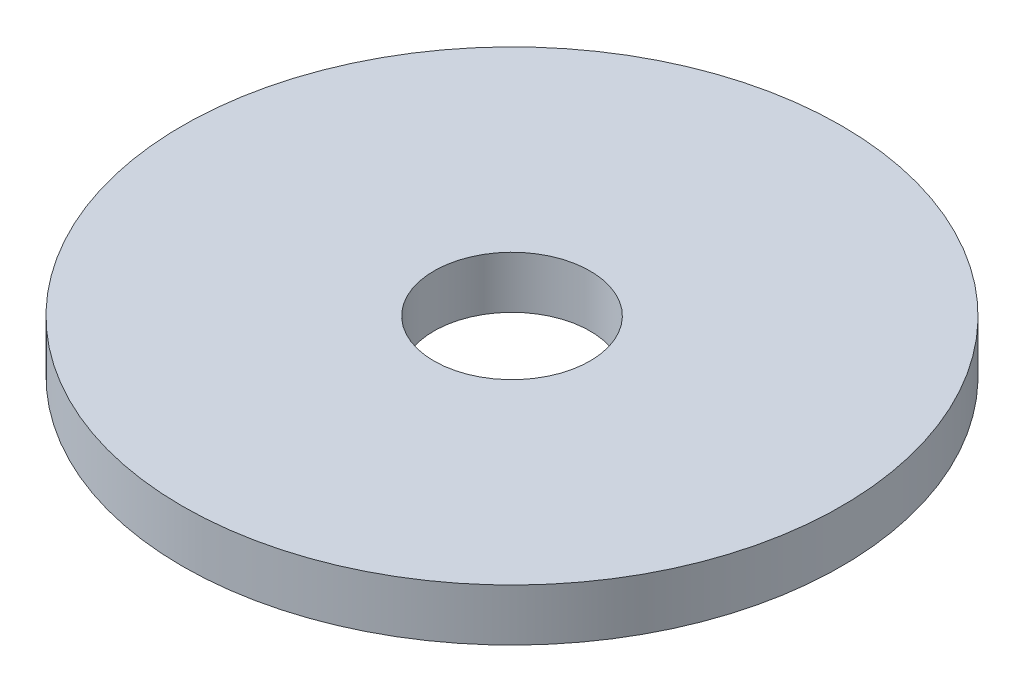
ISO-10303-21;
HEADER;
FILE_DESCRIPTION(('STEP AP214'),'2;1');
FILE_NAME('part.step','',(''),(''),'','','');
FILE_SCHEMA(('AUTOMOTIVE_DESIGN { 1 0 10303 214 1 1 1 1 }'));
ENDSEC;
DATA;
#1=APPLICATION_CONTEXT('core data for automotive mechanical design processes');
#2=APPLICATION_PROTOCOL_DEFINITION('international standard','automotive_design',2000,#1);
#3=PRODUCT_CONTEXT('',#1,'mechanical');
#4=PRODUCT('Part','Part','',(#3));
#5=PRODUCT_RELATED_PRODUCT_CATEGORY('part','',(#4));
#6=PRODUCT_DEFINITION_FORMATION('','',#4);
#7=PRODUCT_DEFINITION_CONTEXT('part definition',#1,'design');
#8=PRODUCT_DEFINITION('design','',#6,#7);
#9=PRODUCT_DEFINITION_SHAPE('','',#8);
#10=(LENGTH_UNIT() NAMED_UNIT(*) SI_UNIT(.MILLI.,.METRE.));
#11=(NAMED_UNIT(*) PLANE_ANGLE_UNIT() SI_UNIT($,.RADIAN.));
#12=(NAMED_UNIT(*) SI_UNIT($,.STERADIAN.) SOLID_ANGLE_UNIT());
#13=UNCERTAINTY_MEASURE_WITH_UNIT(LENGTH_MEASURE(1.E-05),#10,'distance_accuracy_value','');
#14=(GEOMETRIC_REPRESENTATION_CONTEXT(3) GLOBAL_UNCERTAINTY_ASSIGNED_CONTEXT((#13)) GLOBAL_UNIT_ASSIGNED_CONTEXT((#10,
#11,#12)) REPRESENTATION_CONTEXT('',''));
#15=CARTESIAN_POINT('',(0.,0.,0.));
#16=DIRECTION('',(0.,0.,1.));
#17=DIRECTION('',(1.,0.,0.));
#18=AXIS2_PLACEMENT_3D('',#15,#16,#17);
#19=CARTESIAN_POINT('',(0.,15.,0.));
#20=DIRECTION('',(0.,-1.,0.));
#21=DIRECTION('',(0.,0.,-1.));
#22=AXIS2_PLACEMENT_3D('',#19,#20,#21);
#23=CYLINDRICAL_SURFACE('',#22,95.);
#24=CARTESIAN_POINT('',(0.,15.,0.));
#25=DIRECTION('',(0.,1.,0.));
#26=DIRECTION('',(0.,0.,1.));
#27=AXIS2_PLACEMENT_3D('',#24,#25,#26);
#28=CIRCLE('',#27,95.);
#29=CARTESIAN_POINT('',(0.,15.,95.));
#30=VERTEX_POINT('',#29);
#31=EDGE_CURVE('E10',#30,#30,#28,.T.);
#32=ORIENTED_EDGE('',*,*,#31,.F.);
#33=EDGE_LOOP('',(#32));
#34=FACE_BOUND('',#33,.T.);
#35=CARTESIAN_POINT('',(0.,0.,0.));
#36=DIRECTION('',(0.,1.,0.));
#37=DIRECTION('',(0.,0.,1.));
#38=AXIS2_PLACEMENT_3D('',#35,#36,#37);
#39=CIRCLE('',#38,95.);
#40=CARTESIAN_POINT('',(0.,0.,95.));
#41=VERTEX_POINT('',#40);
#42=EDGE_CURVE('E37',#41,#41,#39,.T.);
#43=ORIENTED_EDGE('',*,*,#42,.T.);
#44=EDGE_LOOP('',(#43));
#45=FACE_BOUND('',#44,.T.);
#46=ADVANCED_FACE('F40',(#34,#45),#23,.T.);
#47=CARTESIAN_POINT('',(0.,15.,0.));
#48=DIRECTION('',(0.,1.,0.));
#49=DIRECTION('',(0.,0.,1.));
#50=AXIS2_PLACEMENT_3D('',#47,#48,#49);
#51=PLANE('',#50);
#52=CARTESIAN_POINT('',(0.,15.,0.));
#53=DIRECTION('',(0.,1.,0.));
#54=DIRECTION('',(0.,0.,1.));
#55=AXIS2_PLACEMENT_3D('',#52,#53,#54);
#56=CIRCLE('',#55,22.5);
#57=CARTESIAN_POINT('',(0.,15.,22.5));
#58=VERTEX_POINT('',#57);
#59=EDGE_CURVE('E50',#58,#58,#56,.T.);
#60=ORIENTED_EDGE('',*,*,#59,.F.);
#61=EDGE_LOOP('',(#60));
#62=FACE_BOUND('',#61,.T.);
#63=ORIENTED_EDGE('',*,*,#31,.T.);
#64=EDGE_LOOP('',(#63));
#65=FACE_BOUND('',#64,.T.);
#66=ADVANCED_FACE('F59',(#62,#65),#51,.T.);
#67=CARTESIAN_POINT('',(0.,0.,0.));
#68=DIRECTION('',(0.,1.,0.));
#69=DIRECTION('',(0.,0.,1.));
#70=AXIS2_PLACEMENT_3D('',#67,#68,#69);
#71=PLANE('',#70);
#72=CARTESIAN_POINT('',(0.,0.,0.));
#73=DIRECTION('',(0.,1.,0.));
#74=DIRECTION('',(0.,0.,1.));
#75=AXIS2_PLACEMENT_3D('',#72,#73,#74);
#76=CIRCLE('',#75,22.5);
#77=CARTESIAN_POINT('',(0.,0.,22.5));
#78=VERTEX_POINT('',#77);
#79=EDGE_CURVE('E47',#78,#78,#76,.T.);
#80=ORIENTED_EDGE('',*,*,#79,.T.);
#81=EDGE_LOOP('',(#80));
#82=FACE_BOUND('',#81,.T.);
#83=ORIENTED_EDGE('',*,*,#42,.F.);
#84=EDGE_LOOP('',(#83));
#85=FACE_BOUND('',#84,.T.);
#86=ADVANCED_FACE('F58',(#82,#85),#71,.F.);
#87=CARTESIAN_POINT('',(0.,15.,0.));
#88=DIRECTION('',(0.,-1.,0.));
#89=DIRECTION('',(0.,0.,-1.));
#90=AXIS2_PLACEMENT_3D('',#87,#88,#89);
#91=CYLINDRICAL_SURFACE('',#90,22.5);
#92=ORIENTED_EDGE('',*,*,#59,.T.);
#93=EDGE_LOOP('',(#92));
#94=FACE_BOUND('',#93,.T.);
#95=ORIENTED_EDGE('',*,*,#79,.F.);
#96=EDGE_LOOP('',(#95));
#97=FACE_BOUND('',#96,.T.);
#98=ADVANCED_FACE('F54',(#94,#97),#91,.F.);
#99=CLOSED_SHELL('',(#46,#66,#86,#98));
#100=MANIFOLD_SOLID_BREP('B2',#99);
#101=ADVANCED_BREP_SHAPE_REPRESENTATION('',(#18,#100),#14);
#102=SHAPE_DEFINITION_REPRESENTATION(#9,#101);
ENDSEC;
END-ISO-10303-21;
